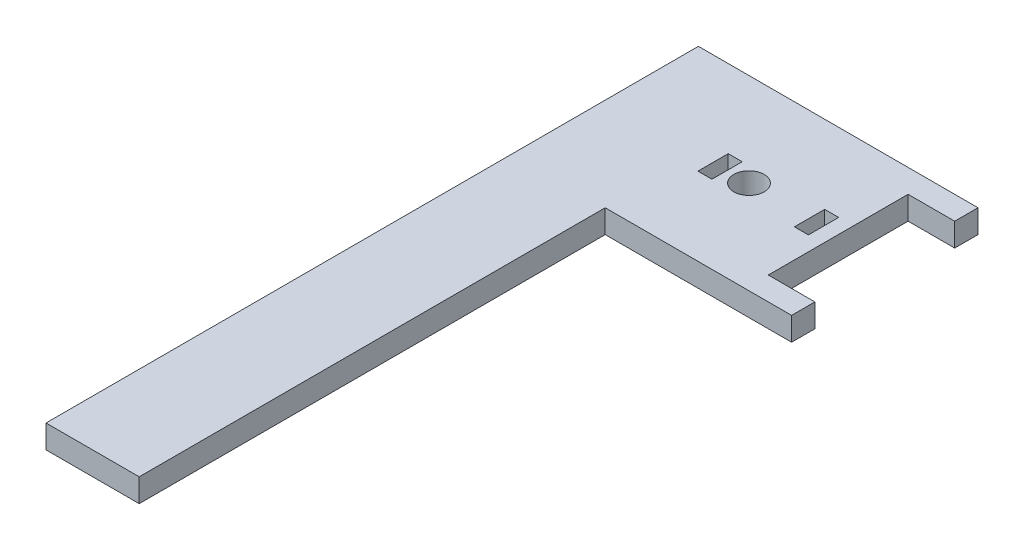
ISO-10303-21;
HEADER;
FILE_DESCRIPTION(('STEP AP214'),'2;1');
FILE_NAME('part.step','',(''),(''),'','','');
FILE_SCHEMA(('AUTOMOTIVE_DESIGN { 1 0 10303 214 1 1 1 1 }'));
ENDSEC;
DATA;
#1=APPLICATION_CONTEXT('core data for automotive mechanical design processes');
#2=APPLICATION_PROTOCOL_DEFINITION('international standard','automotive_design',2000,#1);
#3=PRODUCT_CONTEXT('',#1,'mechanical');
#4=PRODUCT('Part','Part','',(#3));
#5=PRODUCT_RELATED_PRODUCT_CATEGORY('part','',(#4));
#6=PRODUCT_DEFINITION_FORMATION('','',#4);
#7=PRODUCT_DEFINITION_CONTEXT('part definition',#1,'design');
#8=PRODUCT_DEFINITION('design','',#6,#7);
#9=PRODUCT_DEFINITION_SHAPE('','',#8);
#10=(LENGTH_UNIT() NAMED_UNIT(*) SI_UNIT(.MILLI.,.METRE.));
#11=(NAMED_UNIT(*) PLANE_ANGLE_UNIT() SI_UNIT($,.RADIAN.));
#12=(NAMED_UNIT(*) SI_UNIT($,.STERADIAN.) SOLID_ANGLE_UNIT());
#13=UNCERTAINTY_MEASURE_WITH_UNIT(LENGTH_MEASURE(1.E-05),#10,'distance_accuracy_value','');
#14=(GEOMETRIC_REPRESENTATION_CONTEXT(3) GLOBAL_UNCERTAINTY_ASSIGNED_CONTEXT((#13)) GLOBAL_UNIT_ASSIGNED_CONTEXT((#10,
#11,#12)) REPRESENTATION_CONTEXT('',''));
#15=CARTESIAN_POINT('',(0.,0.,0.));
#16=DIRECTION('',(0.,0.,1.));
#17=DIRECTION('',(1.,0.,0.));
#18=AXIS2_PLACEMENT_3D('',#15,#16,#17);
#19=CARTESIAN_POINT('',(0.,5.,20.));
#20=DIRECTION('',(0.,0.,-1.));
#21=DIRECTION('',(-1.,0.,0.));
#22=AXIS2_PLACEMENT_3D('',#19,#20,#21);
#23=PLANE('',#22);
#24=DIRECTION('',(1.,0.,0.));
#25=VECTOR('',#24,1.);
#26=CARTESIAN_POINT('',(0.,0.,20.));
#27=LINE('',#26,#25);
#28=CARTESIAN_POINT('',(-60.,0.,20.));
#29=VERTEX_POINT('',#28);
#30=CARTESIAN_POINT('',(-20.,0.,20.));
#31=VERTEX_POINT('',#30);
#32=EDGE_CURVE('E276',#29,#31,#27,.T.);
#33=ORIENTED_EDGE('',*,*,#32,.T.);
#34=DIRECTION('',(0.,-1.,0.));
#35=VECTOR('',#34,1.);
#36=CARTESIAN_POINT('',(-20.,5.,20.));
#37=LINE('',#36,#35);
#38=CARTESIAN_POINT('',(-20.,5.,20.));
#39=VERTEX_POINT('',#38);
#40=EDGE_CURVE('E11',#39,#31,#37,.T.);
#41=ORIENTED_EDGE('',*,*,#40,.F.);
#42=DIRECTION('',(1.,0.,0.));
#43=VECTOR('',#42,1.);
#44=CARTESIAN_POINT('',(0.,5.,20.));
#45=LINE('',#44,#43);
#46=CARTESIAN_POINT('',(-60.,5.,20.));
#47=VERTEX_POINT('',#46);
#48=EDGE_CURVE('E256',#47,#39,#45,.T.);
#49=ORIENTED_EDGE('',*,*,#48,.F.);
#50=DIRECTION('',(0.,-1.,0.));
#51=VECTOR('',#50,1.);
#52=CARTESIAN_POINT('',(-60.,5.,20.));
#53=LINE('',#52,#51);
#54=EDGE_CURVE('E273',#47,#29,#53,.T.);
#55=ORIENTED_EDGE('',*,*,#54,.T.);
#56=EDGE_LOOP('',(#33,#41,#49,#55));
#57=FACE_BOUND('',#56,.T.);
#58=ADVANCED_FACE('F34',(#57),#23,.F.);
#59=CARTESIAN_POINT('',(-20.,5.,0.));
#60=DIRECTION('',(-1.,0.,0.));
#61=DIRECTION('',(0.,0.,1.));
#62=AXIS2_PLACEMENT_3D('',#59,#60,#61);
#63=PLANE('',#62);
#64=DIRECTION('',(0.,0.,-1.));
#65=VECTOR('',#64,1.);
#66=CARTESIAN_POINT('',(-20.,0.,0.));
#67=LINE('',#66,#65);
#68=CARTESIAN_POINT('',(-20.,0.,15.));
#69=VERTEX_POINT('',#68);
#70=EDGE_CURVE('E279',#31,#69,#67,.T.);
#71=ORIENTED_EDGE('',*,*,#70,.T.);
#72=DIRECTION('',(0.,-1.,0.));
#73=VECTOR('',#72,1.);
#74=CARTESIAN_POINT('',(-20.,5.,15.));
#75=LINE('',#74,#73);
#76=CARTESIAN_POINT('',(-20.,5.,15.));
#77=VERTEX_POINT('',#76);
#78=EDGE_CURVE('E42',#77,#69,#75,.T.);
#79=ORIENTED_EDGE('',*,*,#78,.F.);
#80=DIRECTION('',(0.,0.,-1.));
#81=VECTOR('',#80,1.);
#82=CARTESIAN_POINT('',(-20.,5.,0.));
#83=LINE('',#82,#81);
#84=EDGE_CURVE('E260',#39,#77,#83,.T.);
#85=ORIENTED_EDGE('',*,*,#84,.F.);
#86=ORIENTED_EDGE('',*,*,#40,.T.);
#87=EDGE_LOOP('',(#71,#79,#85,#86));
#88=FACE_BOUND('',#87,.T.);
#89=ADVANCED_FACE('F309',(#88),#63,.F.);
#90=CARTESIAN_POINT('',(0.,5.,15.));
#91=DIRECTION('',(0.,0.,-1.));
#92=DIRECTION('',(-1.,0.,0.));
#93=AXIS2_PLACEMENT_3D('',#90,#91,#92);
#94=PLANE('',#93);
#95=DIRECTION('',(1.,0.,0.));
#96=VECTOR('',#95,1.);
#97=CARTESIAN_POINT('',(0.,0.,15.));
#98=LINE('',#97,#96);
#99=CARTESIAN_POINT('',(-30.,0.,15.));
#100=VERTEX_POINT('',#99);
#101=EDGE_CURVE('E282',#100,#69,#98,.T.);
#102=ORIENTED_EDGE('',*,*,#101,.F.);
#103=DIRECTION('',(0.,-1.,0.));
#104=VECTOR('',#103,1.);
#105=CARTESIAN_POINT('',(-30.,5.,15.));
#106=LINE('',#105,#104);
#107=CARTESIAN_POINT('',(-30.,5.,15.));
#108=VERTEX_POINT('',#107);
#109=EDGE_CURVE('E302',#108,#100,#106,.T.);
#110=ORIENTED_EDGE('',*,*,#109,.F.);
#111=DIRECTION('',(1.,0.,0.));
#112=VECTOR('',#111,1.);
#113=CARTESIAN_POINT('',(0.,5.,15.));
#114=LINE('',#113,#112);
#115=EDGE_CURVE('E262',#108,#77,#114,.T.);
#116=ORIENTED_EDGE('',*,*,#115,.T.);
#117=ORIENTED_EDGE('',*,*,#78,.T.);
#118=EDGE_LOOP('',(#102,#110,#116,#117));
#119=FACE_BOUND('',#118,.T.);
#120=ADVANCED_FACE('F306',(#119),#94,.T.);
#121=CARTESIAN_POINT('',(-30.,5.,0.));
#122=DIRECTION('',(-1.,0.,0.));
#123=DIRECTION('',(0.,0.,1.));
#124=AXIS2_PLACEMENT_3D('',#121,#122,#123);
#125=PLANE('',#124);
#126=DIRECTION('',(0.,0.,-1.));
#127=VECTOR('',#126,1.);
#128=CARTESIAN_POINT('',(-30.,0.,0.));
#129=LINE('',#128,#127);
#130=CARTESIAN_POINT('',(-30.,0.,-15.));
#131=VERTEX_POINT('',#130);
#132=EDGE_CURVE('E286',#100,#131,#129,.T.);
#133=ORIENTED_EDGE('',*,*,#132,.T.);
#134=DIRECTION('',(0.,-1.,0.));
#135=VECTOR('',#134,1.);
#136=CARTESIAN_POINT('',(-30.,5.,-15.));
#137=LINE('',#136,#135);
#138=CARTESIAN_POINT('',(-30.,5.,-15.));
#139=VERTEX_POINT('',#138);
#140=EDGE_CURVE('E299',#139,#131,#137,.T.);
#141=ORIENTED_EDGE('',*,*,#140,.F.);
#142=DIRECTION('',(0.,0.,-1.));
#143=VECTOR('',#142,1.);
#144=CARTESIAN_POINT('',(-30.,5.,0.));
#145=LINE('',#144,#143);
#146=EDGE_CURVE('E266',#108,#139,#145,.T.);
#147=ORIENTED_EDGE('',*,*,#146,.F.);
#148=ORIENTED_EDGE('',*,*,#109,.T.);
#149=EDGE_LOOP('',(#133,#141,#147,#148));
#150=FACE_BOUND('',#149,.T.);
#151=ADVANCED_FACE('F318',(#150),#125,.F.);
#152=CARTESIAN_POINT('',(0.,5.,-15.));
#153=DIRECTION('',(0.,0.,-1.));
#154=DIRECTION('',(-1.,0.,0.));
#155=AXIS2_PLACEMENT_3D('',#152,#153,#154);
#156=PLANE('',#155);
#157=DIRECTION('',(1.,0.,0.));
#158=VECTOR('',#157,1.);
#159=CARTESIAN_POINT('',(0.,0.,-15.));
#160=LINE('',#159,#158);
#161=CARTESIAN_POINT('',(-20.,0.,-15.));
#162=VERTEX_POINT('',#161);
#163=EDGE_CURVE('E288',#131,#162,#160,.T.);
#164=ORIENTED_EDGE('',*,*,#163,.T.);
#165=DIRECTION('',(0.,-1.,0.));
#166=VECTOR('',#165,1.);
#167=CARTESIAN_POINT('',(-20.,5.,-15.));
#168=LINE('',#167,#166);
#169=CARTESIAN_POINT('',(-20.,5.,-15.));
#170=VERTEX_POINT('',#169);
#171=EDGE_CURVE('E296',#170,#162,#168,.T.);
#172=ORIENTED_EDGE('',*,*,#171,.F.);
#173=DIRECTION('',(1.,0.,0.));
#174=VECTOR('',#173,1.);
#175=CARTESIAN_POINT('',(0.,5.,-15.));
#176=LINE('',#175,#174);
#177=EDGE_CURVE('E268',#139,#170,#176,.T.);
#178=ORIENTED_EDGE('',*,*,#177,.F.);
#179=ORIENTED_EDGE('',*,*,#140,.T.);
#180=EDGE_LOOP('',(#164,#172,#178,#179));
#181=FACE_BOUND('',#180,.T.);
#182=ADVANCED_FACE('F322',(#181),#156,.F.);
#183=CARTESIAN_POINT('',(-20.,0.,-20.));
#184=VERTEX_POINT('',#183);
#185=EDGE_CURVE('E283',#162,#184,#67,.T.);
#186=ORIENTED_EDGE('',*,*,#185,.T.);
#187=DIRECTION('',(0.,-1.,0.));
#188=VECTOR('',#187,1.);
#189=CARTESIAN_POINT('',(-20.,5.,-20.));
#190=LINE('',#189,#188);
#191=CARTESIAN_POINT('',(-20.,5.,-20.));
#192=VERTEX_POINT('',#191);
#193=EDGE_CURVE('E294',#192,#184,#190,.T.);
#194=ORIENTED_EDGE('',*,*,#193,.F.);
#195=EDGE_CURVE('E263',#170,#192,#83,.T.);
#196=ORIENTED_EDGE('',*,*,#195,.F.);
#197=ORIENTED_EDGE('',*,*,#171,.T.);
#198=EDGE_LOOP('',(#186,#194,#196,#197));
#199=FACE_BOUND('',#198,.T.);
#200=ADVANCED_FACE('F347',(#199),#63,.F.);
#201=CARTESIAN_POINT('',(0.,5.,-20.));
#202=DIRECTION('',(0.,0.,-1.));
#203=DIRECTION('',(-1.,0.,0.));
#204=AXIS2_PLACEMENT_3D('',#201,#202,#203);
#205=PLANE('',#204);
#206=DIRECTION('',(1.,0.,0.));
#207=VECTOR('',#206,1.);
#208=CARTESIAN_POINT('',(0.,0.,-20.));
#209=LINE('',#208,#207);
#210=CARTESIAN_POINT('',(-80.,0.,-20.));
#211=VERTEX_POINT('',#210);
#212=EDGE_CURVE('E257',#211,#184,#209,.T.);
#213=ORIENTED_EDGE('',*,*,#212,.F.);
#214=DIRECTION('',(0.,-1.,0.));
#215=VECTOR('',#214,1.);
#216=CARTESIAN_POINT('',(-80.,146.42135623731,-20.));
#217=LINE('',#216,#215);
#218=CARTESIAN_POINT('',(-80.,5.,-20.));
#219=VERTEX_POINT('',#218);
#220=EDGE_CURVE('E237',#219,#211,#217,.T.);
#221=ORIENTED_EDGE('',*,*,#220,.F.);
#222=DIRECTION('',(1.,0.,0.));
#223=VECTOR('',#222,1.);
#224=CARTESIAN_POINT('',(0.,5.,-20.));
#225=LINE('',#224,#223);
#226=EDGE_CURVE('E270',#219,#192,#225,.T.);
#227=ORIENTED_EDGE('',*,*,#226,.T.);
#228=ORIENTED_EDGE('',*,*,#193,.T.);
#229=EDGE_LOOP('',(#213,#221,#227,#228));
#230=FACE_BOUND('',#229,.T.);
#231=ADVANCED_FACE('F345',(#230),#205,.T.);
#232=CARTESIAN_POINT('',(-49.15,5.,0.));
#233=DIRECTION('',(0.,-1.,0.));
#234=DIRECTION('',(0.,0.,-1.));
#235=AXIS2_PLACEMENT_3D('',#232,#233,#234);
#236=CYLINDRICAL_SURFACE('',#235,3.25);
#237=CARTESIAN_POINT('',(-49.15,5.,0.));
#238=DIRECTION('',(0.,1.,0.));
#239=DIRECTION('',(0.,0.,1.));
#240=AXIS2_PLACEMENT_3D('',#237,#238,#239);
#241=CIRCLE('',#240,3.25);
#242=CARTESIAN_POINT('',(-49.15,5.,3.25));
#243=VERTEX_POINT('',#242);
#244=EDGE_CURVE('E253',#243,#243,#241,.T.);
#245=ORIENTED_EDGE('',*,*,#244,.T.);
#246=EDGE_LOOP('',(#245));
#247=FACE_BOUND('',#246,.T.);
#248=CARTESIAN_POINT('',(-49.15,0.,0.));
#249=DIRECTION('',(0.,1.,0.));
#250=DIRECTION('',(0.,0.,1.));
#251=AXIS2_PLACEMENT_3D('',#248,#249,#250);
#252=CIRCLE('',#251,3.25);
#253=CARTESIAN_POINT('',(-49.15,0.,3.25));
#254=VERTEX_POINT('',#253);
#255=EDGE_CURVE('E243',#254,#254,#252,.T.);
#256=ORIENTED_EDGE('',*,*,#255,.F.);
#257=EDGE_LOOP('',(#256));
#258=FACE_BOUND('',#257,.T.);
#259=ADVANCED_FACE('F36',(#247,#258),#236,.F.);
#260=CARTESIAN_POINT('',(0.,5.,0.));
#261=DIRECTION('',(0.,1.,0.));
#262=DIRECTION('',(0.,0.,1.));
#263=AXIS2_PLACEMENT_3D('',#260,#261,#262);
#264=PLANE('',#263);
#265=DIRECTION('',(0.,0.,-1.));
#266=VECTOR('',#265,1.);
#267=CARTESIAN_POINT('',(-33.15,5.,0.));
#268=LINE('',#267,#266);
#269=CARTESIAN_POINT('',(-33.15,5.,3.25));
#270=VERTEX_POINT('',#269);
#271=CARTESIAN_POINT('',(-33.15,5.,-3.25));
#272=VERTEX_POINT('',#271);
#273=EDGE_CURVE('E164',#270,#272,#268,.T.);
#274=ORIENTED_EDGE('',*,*,#273,.F.);
#275=DIRECTION('',(1.,0.,0.));
#276=VECTOR('',#275,1.);
#277=CARTESIAN_POINT('',(0.,5.,3.24999999999999));
#278=LINE('',#277,#276);
#279=CARTESIAN_POINT('',(-36.15,5.,3.25));
#280=VERTEX_POINT('',#279);
#281=EDGE_CURVE('E225',#280,#270,#278,.T.);
#282=ORIENTED_EDGE('',*,*,#281,.F.);
#283=DIRECTION('',(0.,0.,1.));
#284=VECTOR('',#283,1.);
#285=CARTESIAN_POINT('',(-36.15,5.,0.));
#286=LINE('',#285,#284);
#287=CARTESIAN_POINT('',(-36.15,5.,-3.25));
#288=VERTEX_POINT('',#287);
#289=EDGE_CURVE('E223',#288,#280,#286,.T.);
#290=ORIENTED_EDGE('',*,*,#289,.F.);
#291=DIRECTION('',(-1.,0.,0.));
#292=VECTOR('',#291,1.);
#293=CARTESIAN_POINT('',(0.,5.,-3.25));
#294=LINE('',#293,#292);
#295=EDGE_CURVE('E221',#272,#288,#294,.T.);
#296=ORIENTED_EDGE('',*,*,#295,.F.);
#297=EDGE_LOOP('',(#274,#282,#290,#296));
#298=FACE_BOUND('',#297,.T.);
#299=DIRECTION('',(0.,0.,-1.));
#300=VECTOR('',#299,1.);
#301=CARTESIAN_POINT('',(-53.85,5.,0.));
#302=LINE('',#301,#300);
#303=CARTESIAN_POINT('',(-53.85,5.,3.24999999999999));
#304=VERTEX_POINT('',#303);
#305=CARTESIAN_POINT('',(-53.85,5.,-3.25));
#306=VERTEX_POINT('',#305);
#307=EDGE_CURVE('E219',#304,#306,#302,.T.);
#308=ORIENTED_EDGE('',*,*,#307,.F.);
#309=DIRECTION('',(1.,0.,0.));
#310=VECTOR('',#309,1.);
#311=CARTESIAN_POINT('',(0.,5.,3.24999999999999));
#312=LINE('',#311,#310);
#313=CARTESIAN_POINT('',(-56.85,5.,3.24999999999999));
#314=VERTEX_POINT('',#313);
#315=EDGE_CURVE('E217',#314,#304,#312,.T.);
#316=ORIENTED_EDGE('',*,*,#315,.F.);
#317=DIRECTION('',(0.,0.,1.));
#318=VECTOR('',#317,1.);
#319=CARTESIAN_POINT('',(-56.85,5.,0.));
#320=LINE('',#319,#318);
#321=CARTESIAN_POINT('',(-56.85,5.,-3.25));
#322=VERTEX_POINT('',#321);
#323=EDGE_CURVE('E215',#322,#314,#320,.T.);
#324=ORIENTED_EDGE('',*,*,#323,.F.);
#325=DIRECTION('',(-1.,0.,0.));
#326=VECTOR('',#325,1.);
#327=CARTESIAN_POINT('',(0.,5.,-3.25));
#328=LINE('',#327,#326);
#329=EDGE_CURVE('E191',#306,#322,#328,.T.);
#330=ORIENTED_EDGE('',*,*,#329,.F.);
#331=EDGE_LOOP('',(#308,#316,#324,#330));
#332=FACE_BOUND('',#331,.T.);
#333=ORIENTED_EDGE('',*,*,#244,.F.);
#334=EDGE_LOOP('',(#333));
#335=FACE_BOUND('',#334,.T.);
#336=ORIENTED_EDGE('',*,*,#48,.T.);
#337=ORIENTED_EDGE('',*,*,#84,.T.);
#338=ORIENTED_EDGE('',*,*,#115,.F.);
#339=ORIENTED_EDGE('',*,*,#146,.T.);
#340=ORIENTED_EDGE('',*,*,#177,.T.);
#341=ORIENTED_EDGE('',*,*,#195,.T.);
#342=ORIENTED_EDGE('',*,*,#226,.F.);
#343=DIRECTION('',(0.,0.,1.));
#344=VECTOR('',#343,1.);
#345=CARTESIAN_POINT('',(-80.,5.,-20.));
#346=LINE('',#345,#344);
#347=CARTESIAN_POINT('',(-80.,5.,120.));
#348=VERTEX_POINT('',#347);
#349=EDGE_CURVE('E240',#219,#348,#346,.T.);
#350=ORIENTED_EDGE('',*,*,#349,.T.);
#351=DIRECTION('',(1.,0.,0.));
#352=VECTOR('',#351,1.);
#353=CARTESIAN_POINT('',(-60.,5.,120.));
#354=LINE('',#353,#352);
#355=CARTESIAN_POINT('',(-60.,5.,120.));
#356=VERTEX_POINT('',#355);
#357=EDGE_CURVE('E232',#348,#356,#354,.T.);
#358=ORIENTED_EDGE('',*,*,#357,.T.);
#359=DIRECTION('',(0.,0.,-1.));
#360=VECTOR('',#359,1.);
#361=CARTESIAN_POINT('',(-60.,5.,-20.));
#362=LINE('',#361,#360);
#363=EDGE_CURVE('E244',#356,#47,#362,.T.);
#364=ORIENTED_EDGE('',*,*,#363,.T.);
#365=EDGE_LOOP('',(#336,#337,#338,#339,#340,#341,#342,#350,#358,#364));
#366=FACE_BOUND('',#365,.T.);
#367=ADVANCED_FACE('F326',(#298,#332,#335,#366),#264,.T.);
#368=CARTESIAN_POINT('',(0.,0.,0.));
#369=DIRECTION('',(0.,1.,0.));
#370=DIRECTION('',(0.,0.,1.));
#371=AXIS2_PLACEMENT_3D('',#368,#369,#370);
#372=PLANE('',#371);
#373=DIRECTION('',(1.,0.,0.));
#374=VECTOR('',#373,1.);
#375=CARTESIAN_POINT('',(-36.15,0.,3.25));
#376=LINE('',#375,#374);
#377=CARTESIAN_POINT('',(-36.15,0.,3.25));
#378=VERTEX_POINT('',#377);
#379=CARTESIAN_POINT('',(-33.15,0.,3.25));
#380=VERTEX_POINT('',#379);
#381=EDGE_CURVE('E167',#378,#380,#376,.T.);
#382=ORIENTED_EDGE('',*,*,#381,.T.);
#383=DIRECTION('',(0.,0.,-1.));
#384=VECTOR('',#383,1.);
#385=CARTESIAN_POINT('',(-33.15,0.,-3.25));
#386=LINE('',#385,#384);
#387=CARTESIAN_POINT('',(-33.15,0.,-3.25));
#388=VERTEX_POINT('',#387);
#389=EDGE_CURVE('E161',#380,#388,#386,.T.);
#390=ORIENTED_EDGE('',*,*,#389,.T.);
#391=DIRECTION('',(-1.,0.,0.));
#392=VECTOR('',#391,1.);
#393=CARTESIAN_POINT('',(-36.15,0.,-3.25));
#394=LINE('',#393,#392);
#395=CARTESIAN_POINT('',(-36.15,0.,-3.25));
#396=VERTEX_POINT('',#395);
#397=EDGE_CURVE('E171',#388,#396,#394,.T.);
#398=ORIENTED_EDGE('',*,*,#397,.T.);
#399=DIRECTION('',(0.,0.,1.));
#400=VECTOR('',#399,1.);
#401=CARTESIAN_POINT('',(-36.15,0.,-3.25));
#402=LINE('',#401,#400);
#403=EDGE_CURVE('E176',#396,#378,#402,.T.);
#404=ORIENTED_EDGE('',*,*,#403,.T.);
#405=EDGE_LOOP('',(#382,#390,#398,#404));
#406=FACE_BOUND('',#405,.T.);
#407=DIRECTION('',(1.,0.,0.));
#408=VECTOR('',#407,1.);
#409=CARTESIAN_POINT('',(-56.85,0.,3.24999999999999));
#410=LINE('',#409,#408);
#411=CARTESIAN_POINT('',(-56.85,0.,3.24999999999999));
#412=VERTEX_POINT('',#411);
#413=CARTESIAN_POINT('',(-53.85,0.,3.24999999999999));
#414=VERTEX_POINT('',#413);
#415=EDGE_CURVE('E205',#412,#414,#410,.T.);
#416=ORIENTED_EDGE('',*,*,#415,.T.);
#417=DIRECTION('',(0.,0.,-1.));
#418=VECTOR('',#417,1.);
#419=CARTESIAN_POINT('',(-53.85,0.,-3.25));
#420=LINE('',#419,#418);
#421=CARTESIAN_POINT('',(-53.85,0.,-3.25));
#422=VERTEX_POINT('',#421);
#423=EDGE_CURVE('E196',#414,#422,#420,.T.);
#424=ORIENTED_EDGE('',*,*,#423,.T.);
#425=DIRECTION('',(-1.,0.,0.));
#426=VECTOR('',#425,1.);
#427=CARTESIAN_POINT('',(-56.85,0.,-3.25));
#428=LINE('',#427,#426);
#429=CARTESIAN_POINT('',(-56.85,0.,-3.25));
#430=VERTEX_POINT('',#429);
#431=EDGE_CURVE('E199',#422,#430,#428,.T.);
#432=ORIENTED_EDGE('',*,*,#431,.T.);
#433=DIRECTION('',(0.,0.,1.));
#434=VECTOR('',#433,1.);
#435=CARTESIAN_POINT('',(-56.85,0.,-3.25));
#436=LINE('',#435,#434);
#437=EDGE_CURVE('E202',#430,#412,#436,.T.);
#438=ORIENTED_EDGE('',*,*,#437,.T.);
#439=EDGE_LOOP('',(#416,#424,#432,#438));
#440=FACE_BOUND('',#439,.T.);
#441=ORIENTED_EDGE('',*,*,#255,.T.);
#442=EDGE_LOOP('',(#441));
#443=FACE_BOUND('',#442,.T.);
#444=ORIENTED_EDGE('',*,*,#32,.F.);
#445=DIRECTION('',(0.,0.,-1.));
#446=VECTOR('',#445,1.);
#447=CARTESIAN_POINT('',(-60.,0.,-20.));
#448=LINE('',#447,#446);
#449=CARTESIAN_POINT('',(-60.,0.,120.));
#450=VERTEX_POINT('',#449);
#451=EDGE_CURVE('E238',#450,#29,#448,.T.);
#452=ORIENTED_EDGE('',*,*,#451,.F.);
#453=DIRECTION('',(1.,0.,0.));
#454=VECTOR('',#453,1.);
#455=CARTESIAN_POINT('',(-60.,0.,120.));
#456=LINE('',#455,#454);
#457=CARTESIAN_POINT('',(-80.,0.,120.));
#458=VERTEX_POINT('',#457);
#459=EDGE_CURVE('E229',#458,#450,#456,.T.);
#460=ORIENTED_EDGE('',*,*,#459,.F.);
#461=DIRECTION('',(0.,0.,1.));
#462=VECTOR('',#461,1.);
#463=CARTESIAN_POINT('',(-80.,0.,-20.));
#464=LINE('',#463,#462);
#465=EDGE_CURVE('E234',#211,#458,#464,.T.);
#466=ORIENTED_EDGE('',*,*,#465,.F.);
#467=ORIENTED_EDGE('',*,*,#212,.T.);
#468=ORIENTED_EDGE('',*,*,#185,.F.);
#469=ORIENTED_EDGE('',*,*,#163,.F.);
#470=ORIENTED_EDGE('',*,*,#132,.F.);
#471=ORIENTED_EDGE('',*,*,#101,.T.);
#472=ORIENTED_EDGE('',*,*,#70,.F.);
#473=EDGE_LOOP('',(#444,#452,#460,#466,#467,#468,#469,#470,#471,#472));
#474=FACE_BOUND('',#473,.T.);
#475=ADVANCED_FACE('F178',(#406,#440,#443,#474),#372,.F.);
#476=CARTESIAN_POINT('',(-60.,146.42135623731,-20.));
#477=DIRECTION('',(-1.,0.,0.));
#478=DIRECTION('',(0.,0.,1.));
#479=AXIS2_PLACEMENT_3D('',#476,#477,#478);
#480=PLANE('',#479);
#481=ORIENTED_EDGE('',*,*,#54,.F.);
#482=ORIENTED_EDGE('',*,*,#363,.F.);
#483=DIRECTION('',(0.,-1.,0.));
#484=VECTOR('',#483,1.);
#485=CARTESIAN_POINT('',(-60.,146.42135623731,120.));
#486=LINE('',#485,#484);
#487=EDGE_CURVE('E228',#356,#450,#486,.T.);
#488=ORIENTED_EDGE('',*,*,#487,.T.);
#489=ORIENTED_EDGE('',*,*,#451,.T.);
#490=EDGE_LOOP('',(#481,#482,#488,#489));
#491=FACE_BOUND('',#490,.T.);
#492=ADVANCED_FACE('F335',(#491),#480,.F.);
#493=CARTESIAN_POINT('',(-80.,146.42135623731,-20.));
#494=DIRECTION('',(1.,0.,0.));
#495=DIRECTION('',(0.,0.,-1.));
#496=AXIS2_PLACEMENT_3D('',#493,#494,#495);
#497=PLANE('',#496);
#498=ORIENTED_EDGE('',*,*,#349,.F.);
#499=ORIENTED_EDGE('',*,*,#220,.T.);
#500=ORIENTED_EDGE('',*,*,#465,.T.);
#501=DIRECTION('',(0.,-1.,0.));
#502=VECTOR('',#501,1.);
#503=CARTESIAN_POINT('',(-80.,146.42135623731,120.));
#504=LINE('',#503,#502);
#505=EDGE_CURVE('E233',#348,#458,#504,.T.);
#506=ORIENTED_EDGE('',*,*,#505,.F.);
#507=EDGE_LOOP('',(#498,#499,#500,#506));
#508=FACE_BOUND('',#507,.T.);
#509=ADVANCED_FACE('F341',(#508),#497,.F.);
#510=CARTESIAN_POINT('',(-60.,146.42135623731,120.));
#511=DIRECTION('',(0.,0.,-1.));
#512=DIRECTION('',(-1.,0.,0.));
#513=AXIS2_PLACEMENT_3D('',#510,#511,#512);
#514=PLANE('',#513);
#515=ORIENTED_EDGE('',*,*,#357,.F.);
#516=ORIENTED_EDGE('',*,*,#505,.T.);
#517=ORIENTED_EDGE('',*,*,#459,.T.);
#518=ORIENTED_EDGE('',*,*,#487,.F.);
#519=EDGE_LOOP('',(#515,#516,#517,#518));
#520=FACE_BOUND('',#519,.T.);
#521=ADVANCED_FACE('F338',(#520),#514,.F.);
#522=CARTESIAN_POINT('',(-53.85,0.,-3.25));
#523=DIRECTION('',(1.,0.,0.));
#524=DIRECTION('',(0.,0.,-1.));
#525=AXIS2_PLACEMENT_3D('',#522,#523,#524);
#526=PLANE('',#525);
#527=ORIENTED_EDGE('',*,*,#307,.T.);
#528=DIRECTION('',(0.,1.,0.));
#529=VECTOR('',#528,1.);
#530=CARTESIAN_POINT('',(-53.85,0.,-3.25));
#531=LINE('',#530,#529);
#532=EDGE_CURVE('E57',#422,#306,#531,.T.);
#533=ORIENTED_EDGE('',*,*,#532,.F.);
#534=ORIENTED_EDGE('',*,*,#423,.F.);
#535=DIRECTION('',(0.,1.,0.));
#536=VECTOR('',#535,1.);
#537=CARTESIAN_POINT('',(-53.85,0.,3.24999999999999));
#538=LINE('',#537,#536);
#539=EDGE_CURVE('E181',#414,#304,#538,.T.);
#540=ORIENTED_EDGE('',*,*,#539,.T.);
#541=EDGE_LOOP('',(#527,#533,#534,#540));
#542=FACE_BOUND('',#541,.T.);
#543=ADVANCED_FACE('F427',(#542),#526,.F.);
#544=CARTESIAN_POINT('',(-56.85,0.,3.24999999999999));
#545=DIRECTION('',(0.,0.,1.));
#546=DIRECTION('',(1.,0.,0.));
#547=AXIS2_PLACEMENT_3D('',#544,#545,#546);
#548=PLANE('',#547);
#549=ORIENTED_EDGE('',*,*,#315,.T.);
#550=ORIENTED_EDGE('',*,*,#539,.F.);
#551=ORIENTED_EDGE('',*,*,#415,.F.);
#552=DIRECTION('',(0.,1.,0.));
#553=VECTOR('',#552,1.);
#554=CARTESIAN_POINT('',(-56.85,0.,3.24999999999999));
#555=LINE('',#554,#553);
#556=EDGE_CURVE('E184',#412,#314,#555,.T.);
#557=ORIENTED_EDGE('',*,*,#556,.T.);
#558=EDGE_LOOP('',(#549,#550,#551,#557));
#559=FACE_BOUND('',#558,.T.);
#560=ADVANCED_FACE('F449',(#559),#548,.F.);
#561=CARTESIAN_POINT('',(-56.85,0.,-3.25));
#562=DIRECTION('',(-1.,0.,0.));
#563=DIRECTION('',(0.,0.,1.));
#564=AXIS2_PLACEMENT_3D('',#561,#562,#563);
#565=PLANE('',#564);
#566=ORIENTED_EDGE('',*,*,#323,.T.);
#567=ORIENTED_EDGE('',*,*,#556,.F.);
#568=ORIENTED_EDGE('',*,*,#437,.F.);
#569=DIRECTION('',(0.,1.,0.));
#570=VECTOR('',#569,1.);
#571=CARTESIAN_POINT('',(-56.85,0.,-3.25));
#572=LINE('',#571,#570);
#573=EDGE_CURVE('E210',#430,#322,#572,.T.);
#574=ORIENTED_EDGE('',*,*,#573,.T.);
#575=EDGE_LOOP('',(#566,#567,#568,#574));
#576=FACE_BOUND('',#575,.T.);
#577=ADVANCED_FACE('F459',(#576),#565,.F.);
#578=CARTESIAN_POINT('',(-56.85,0.,-3.25));
#579=DIRECTION('',(0.,0.,-1.));
#580=DIRECTION('',(-1.,0.,0.));
#581=AXIS2_PLACEMENT_3D('',#578,#579,#580);
#582=PLANE('',#581);
#583=ORIENTED_EDGE('',*,*,#329,.T.);
#584=ORIENTED_EDGE('',*,*,#573,.F.);
#585=ORIENTED_EDGE('',*,*,#431,.F.);
#586=ORIENTED_EDGE('',*,*,#532,.T.);
#587=EDGE_LOOP('',(#583,#584,#585,#586));
#588=FACE_BOUND('',#587,.T.);
#589=ADVANCED_FACE('F469',(#588),#582,.F.);
#590=CARTESIAN_POINT('',(-33.15,0.,-3.25));
#591=DIRECTION('',(1.,0.,0.));
#592=DIRECTION('',(0.,0.,-1.));
#593=AXIS2_PLACEMENT_3D('',#590,#591,#592);
#594=PLANE('',#593);
#595=ORIENTED_EDGE('',*,*,#273,.T.);
#596=DIRECTION('',(0.,1.,0.));
#597=VECTOR('',#596,1.);
#598=CARTESIAN_POINT('',(-33.15,0.,-3.25));
#599=LINE('',#598,#597);
#600=EDGE_CURVE('E49',#388,#272,#599,.T.);
#601=ORIENTED_EDGE('',*,*,#600,.F.);
#602=ORIENTED_EDGE('',*,*,#389,.F.);
#603=DIRECTION('',(0.,1.,0.));
#604=VECTOR('',#603,1.);
#605=CARTESIAN_POINT('',(-33.15,0.,3.25));
#606=LINE('',#605,#604);
#607=EDGE_CURVE('E189',#380,#270,#606,.T.);
#608=ORIENTED_EDGE('',*,*,#607,.T.);
#609=EDGE_LOOP('',(#595,#601,#602,#608));
#610=FACE_BOUND('',#609,.T.);
#611=ADVANCED_FACE('F158',(#610),#594,.F.);
#612=CARTESIAN_POINT('',(-36.15,0.,3.25));
#613=DIRECTION('',(0.,0.,1.));
#614=DIRECTION('',(1.,0.,0.));
#615=AXIS2_PLACEMENT_3D('',#612,#613,#614);
#616=PLANE('',#615);
#617=ORIENTED_EDGE('',*,*,#281,.T.);
#618=ORIENTED_EDGE('',*,*,#607,.F.);
#619=ORIENTED_EDGE('',*,*,#381,.F.);
#620=DIRECTION('',(0.,1.,0.));
#621=VECTOR('',#620,1.);
#622=CARTESIAN_POINT('',(-36.15,0.,3.25));
#623=LINE('',#622,#621);
#624=EDGE_CURVE('E192',#378,#280,#623,.T.);
#625=ORIENTED_EDGE('',*,*,#624,.T.);
#626=EDGE_LOOP('',(#617,#618,#619,#625));
#627=FACE_BOUND('',#626,.T.);
#628=ADVANCED_FACE('F487',(#627),#616,.F.);
#629=CARTESIAN_POINT('',(-36.15,0.,-3.25));
#630=DIRECTION('',(-1.,0.,0.));
#631=DIRECTION('',(0.,0.,1.));
#632=AXIS2_PLACEMENT_3D('',#629,#630,#631);
#633=PLANE('',#632);
#634=ORIENTED_EDGE('',*,*,#289,.T.);
#635=ORIENTED_EDGE('',*,*,#624,.F.);
#636=ORIENTED_EDGE('',*,*,#403,.F.);
#637=DIRECTION('',(0.,1.,0.));
#638=VECTOR('',#637,1.);
#639=CARTESIAN_POINT('',(-36.15,0.,-3.25));
#640=LINE('',#639,#638);
#641=EDGE_CURVE('E166',#396,#288,#640,.T.);
#642=ORIENTED_EDGE('',*,*,#641,.T.);
#643=EDGE_LOOP('',(#634,#635,#636,#642));
#644=FACE_BOUND('',#643,.T.);
#645=ADVANCED_FACE('F496',(#644),#633,.F.);
#646=CARTESIAN_POINT('',(-36.15,0.,-3.25));
#647=DIRECTION('',(0.,0.,-1.));
#648=DIRECTION('',(-1.,0.,0.));
#649=AXIS2_PLACEMENT_3D('',#646,#647,#648);
#650=PLANE('',#649);
#651=ORIENTED_EDGE('',*,*,#295,.T.);
#652=ORIENTED_EDGE('',*,*,#641,.F.);
#653=ORIENTED_EDGE('',*,*,#397,.F.);
#654=ORIENTED_EDGE('',*,*,#600,.T.);
#655=EDGE_LOOP('',(#651,#652,#653,#654));
#656=FACE_BOUND('',#655,.T.);
#657=ADVANCED_FACE('F172',(#656),#650,.F.);
#658=CLOSED_SHELL('',(#58,#89,#120,#151,#182,#200,#231,#259,#367,#475,#492,#509,#521,#543,#560,
#577,#589,#611,#628,#645,#657));
#659=MANIFOLD_SOLID_BREP('B2',#658);
#660=ADVANCED_BREP_SHAPE_REPRESENTATION('',(#18,#659),#14);
#661=SHAPE_DEFINITION_REPRESENTATION(#9,#660);
ENDSEC;
END-ISO-10303-21;
